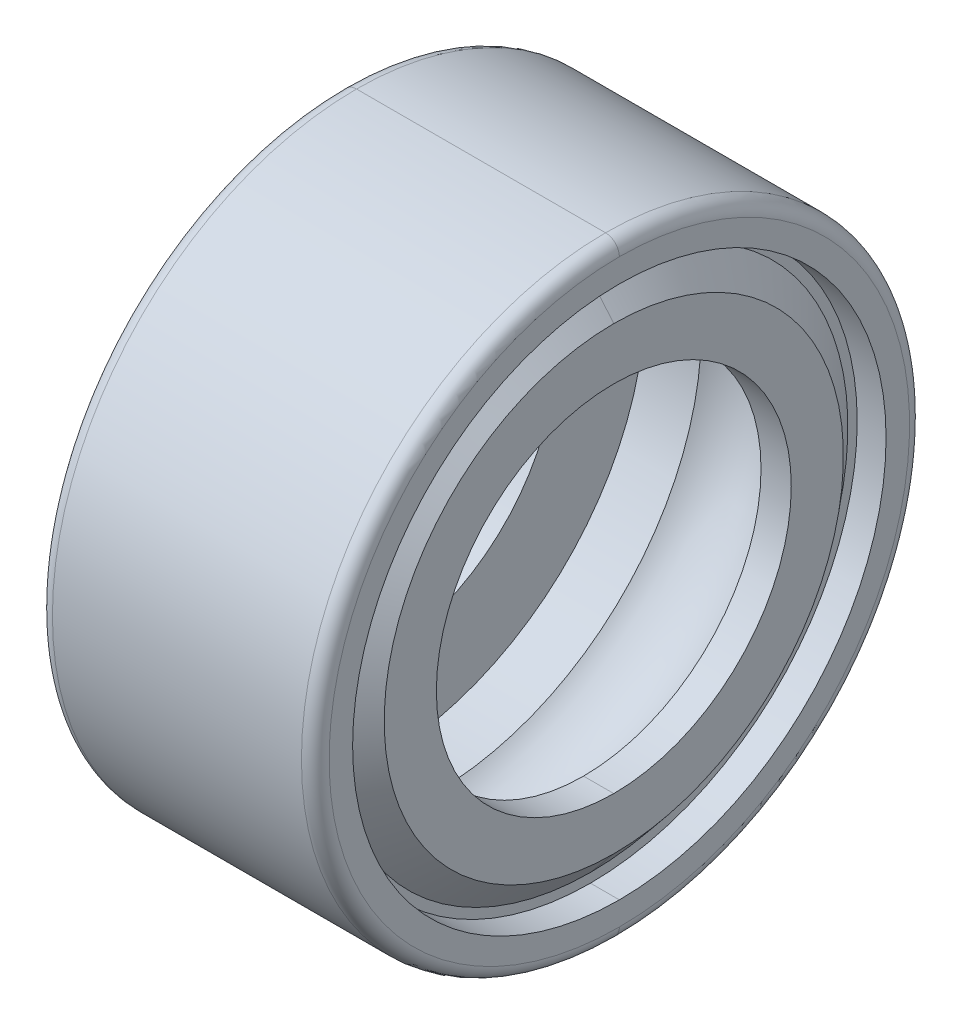
ISO-10303-21;
HEADER;
FILE_DESCRIPTION(('STEP AP214'),'2;1');
FILE_NAME('part.step','',(''),(''),'','','');
FILE_SCHEMA(('AUTOMOTIVE_DESIGN { 1 0 10303 214 1 1 1 1 }'));
ENDSEC;
DATA;
#1=APPLICATION_CONTEXT('core data for automotive mechanical design processes');
#2=APPLICATION_PROTOCOL_DEFINITION('international standard','automotive_design',2000,#1);
#3=PRODUCT_CONTEXT('',#1,'mechanical');
#4=PRODUCT('Part','Part','',(#3));
#5=PRODUCT_RELATED_PRODUCT_CATEGORY('part','',(#4));
#6=PRODUCT_DEFINITION_FORMATION('','',#4);
#7=PRODUCT_DEFINITION_CONTEXT('part definition',#1,'design');
#8=PRODUCT_DEFINITION('design','',#6,#7);
#9=PRODUCT_DEFINITION_SHAPE('','',#8);
#10=(LENGTH_UNIT() NAMED_UNIT(*) SI_UNIT(.MILLI.,.METRE.));
#11=(NAMED_UNIT(*) PLANE_ANGLE_UNIT() SI_UNIT($,.RADIAN.));
#12=(NAMED_UNIT(*) SI_UNIT($,.STERADIAN.) SOLID_ANGLE_UNIT());
#13=UNCERTAINTY_MEASURE_WITH_UNIT(LENGTH_MEASURE(1.E-05),#10,'distance_accuracy_value','');
#14=(GEOMETRIC_REPRESENTATION_CONTEXT(3) GLOBAL_UNCERTAINTY_ASSIGNED_CONTEXT((#13)) GLOBAL_UNIT_ASSIGNED_CONTEXT((#10,
#11,#12)) REPRESENTATION_CONTEXT('',''));
#15=CARTESIAN_POINT('',(0.,0.,0.));
#16=DIRECTION('',(0.,0.,1.));
#17=DIRECTION('',(1.,0.,0.));
#18=AXIS2_PLACEMENT_3D('',#15,#16,#17);
#19=CARTESIAN_POINT('',(-1.97999333714655,0.,0.));
#20=DIRECTION('',(1.,0.,0.));
#21=DIRECTION('',(0.,1.,0.));
#22=AXIS2_PLACEMENT_3D('',#19,#20,#21);
#23=PLANE('',#22);
#24=CARTESIAN_POINT('',(-1.97999333714655,0.,0.));
#25=DIRECTION('',(-1.,0.,0.));
#26=DIRECTION('',(0.,1.,0.));
#27=AXIS2_PLACEMENT_3D('',#24,#25,#26);
#28=CIRCLE('',#27,4.6547982215);
#29=CARTESIAN_POINT('',(-1.97999333714655,4.6547982215,0.));
#30=VERTEX_POINT('',#29);
#31=CARTESIAN_POINT('',(-1.97999333714655,-4.6547982215,0.));
#32=VERTEX_POINT('',#31);
#33=EDGE_CURVE('E305',#30,#32,#28,.T.);
#34=ORIENTED_EDGE('',*,*,#33,.F.);
#35=CARTESIAN_POINT('',(-1.97999333714655,0.,0.));
#36=DIRECTION('',(1.,0.,0.));
#37=DIRECTION('',(0.,1.,0.));
#38=AXIS2_PLACEMENT_3D('',#35,#36,#37);
#39=CIRCLE('',#38,4.6547982215);
#40=EDGE_CURVE('E339',#30,#32,#39,.T.);
#41=ORIENTED_EDGE('',*,*,#40,.T.);
#42=EDGE_LOOP('',(#34,#41));
#43=FACE_BOUND('',#42,.T.);
#44=CARTESIAN_POINT('',(-1.97999333714655,0.,0.));
#45=DIRECTION('',(1.,0.,0.));
#46=DIRECTION('',(0.,-1.,0.));
#47=AXIS2_PLACEMENT_3D('',#44,#45,#46);
#48=CIRCLE('',#47,4.8236251);
#49=CARTESIAN_POINT('',(-1.97999333714655,-4.8236251,0.));
#50=VERTEX_POINT('',#49);
#51=CARTESIAN_POINT('',(-1.97999333714655,4.8236251,0.));
#52=VERTEX_POINT('',#51);
#53=EDGE_CURVE('E28',#50,#52,#48,.T.);
#54=ORIENTED_EDGE('',*,*,#53,.F.);
#55=CARTESIAN_POINT('',(-1.97999333714655,0.,0.));
#56=DIRECTION('',(1.,0.,0.));
#57=DIRECTION('',(0.,1.,0.));
#58=AXIS2_PLACEMENT_3D('',#55,#56,#57);
#59=CIRCLE('',#58,4.8236251);
#60=EDGE_CURVE('E11',#52,#50,#59,.T.);
#61=ORIENTED_EDGE('',*,*,#60,.F.);
#62=EDGE_LOOP('',(#54,#61));
#63=FACE_BOUND('',#62,.T.);
#64=ADVANCED_FACE('F17',(#43,#63),#23,.F.);
#65=CARTESIAN_POINT('',(-2.75209,0.,0.));
#66=DIRECTION('',(1.,0.,0.));
#67=DIRECTION('',(0.,-1.,0.));
#68=AXIS2_PLACEMENT_3D('',#65,#66,#67);
#69=CYLINDRICAL_SURFACE('',#68,4.8236251);
#70=DIRECTION('',(1.,0.,0.));
#71=VECTOR('',#70,1.);
#72=CARTESIAN_POINT('',(-2.5019,-4.8236251,0.));
#73=LINE('',#72,#71);
#74=CARTESIAN_POINT('',(-2.5019,-4.8236251,0.));
#75=VERTEX_POINT('',#74);
#76=EDGE_CURVE('E334',#75,#50,#73,.T.);
#77=ORIENTED_EDGE('',*,*,#76,.F.);
#78=CARTESIAN_POINT('',(-2.5019,0.,0.));
#79=DIRECTION('',(1.,0.,0.));
#80=DIRECTION('',(0.,1.,0.));
#81=AXIS2_PLACEMENT_3D('',#78,#79,#80);
#82=CIRCLE('',#81,4.8236251);
#83=CARTESIAN_POINT('',(-2.5019,4.8236251,0.));
#84=VERTEX_POINT('',#83);
#85=EDGE_CURVE('E335',#84,#75,#82,.T.);
#86=ORIENTED_EDGE('',*,*,#85,.F.);
#87=DIRECTION('',(1.,0.,0.));
#88=VECTOR('',#87,1.);
#89=CARTESIAN_POINT('',(-2.5019,4.8236251,0.));
#90=LINE('',#89,#88);
#91=EDGE_CURVE('E331',#84,#52,#90,.T.);
#92=ORIENTED_EDGE('',*,*,#91,.T.);
#93=ORIENTED_EDGE('',*,*,#60,.T.);
#94=EDGE_LOOP('',(#77,#86,#92,#93));
#95=FACE_BOUND('',#94,.T.);
#96=ADVANCED_FACE('F494',(#95),#69,.F.);
#97=CARTESIAN_POINT('',(-2.75209,0.,0.));
#98=DIRECTION('',(1.,0.,0.));
#99=DIRECTION('',(0.,-1.,0.));
#100=AXIS2_PLACEMENT_3D('',#97,#98,#99);
#101=CYLINDRICAL_SURFACE('',#100,4.8236251);
#102=ORIENTED_EDGE('',*,*,#91,.F.);
#103=CARTESIAN_POINT('',(-2.5019,0.,0.));
#104=DIRECTION('',(-1.,0.,0.));
#105=DIRECTION('',(0.,1.,0.));
#106=AXIS2_PLACEMENT_3D('',#103,#104,#105);
#107=CIRCLE('',#106,4.8236251);
#108=EDGE_CURVE('E368',#84,#75,#107,.T.);
#109=ORIENTED_EDGE('',*,*,#108,.T.);
#110=ORIENTED_EDGE('',*,*,#76,.T.);
#111=ORIENTED_EDGE('',*,*,#53,.T.);
#112=EDGE_LOOP('',(#102,#109,#110,#111));
#113=FACE_BOUND('',#112,.T.);
#114=ADVANCED_FACE('F500',(#113),#101,.F.);
#115=CARTESIAN_POINT('',(-2.5019,0.,0.));
#116=DIRECTION('',(1.,0.,0.));
#117=DIRECTION('',(0.,1.,0.));
#118=AXIS2_PLACEMENT_3D('',#115,#116,#117);
#119=PLANE('',#118);
#120=ORIENTED_EDGE('',*,*,#108,.F.);
#121=ORIENTED_EDGE('',*,*,#85,.T.);
#122=EDGE_LOOP('',(#120,#121));
#123=FACE_BOUND('',#122,.T.);
#124=CARTESIAN_POINT('',(-2.5019,0.,0.));
#125=DIRECTION('',(1.,0.,0.));
#126=DIRECTION('',(0.,1.,0.));
#127=AXIS2_PLACEMENT_3D('',#124,#125,#126);
#128=CIRCLE('',#127,5.24891);
#129=CARTESIAN_POINT('',(-2.5019,5.24891,0.));
#130=VERTEX_POINT('',#129);
#131=CARTESIAN_POINT('',(-2.5019,-5.24891,0.));
#132=VERTEX_POINT('',#131);
#133=EDGE_CURVE('E292',#130,#132,#128,.T.);
#134=ORIENTED_EDGE('',*,*,#133,.F.);
#135=CARTESIAN_POINT('',(-2.5019,0.,0.));
#136=DIRECTION('',(-1.,0.,0.));
#137=DIRECTION('',(0.,1.,0.));
#138=AXIS2_PLACEMENT_3D('',#135,#136,#137);
#139=CIRCLE('',#138,5.24891);
#140=EDGE_CURVE('E327',#130,#132,#139,.T.);
#141=ORIENTED_EDGE('',*,*,#140,.T.);
#142=EDGE_LOOP('',(#134,#141));
#143=FACE_BOUND('',#142,.T.);
#144=ADVANCED_FACE('F489',(#123,#143),#119,.F.);
#145=CARTESIAN_POINT('',(-2.25171,0.,0.));
#146=DIRECTION('',(1.,0.,0.));
#147=DIRECTION('',(0.,-1.,0.));
#148=AXIS2_PLACEMENT_3D('',#145,#146,#147);
#149=TOROIDAL_SURFACE('',#148,5.24891,0.25019);
#150=CARTESIAN_POINT('',(-2.25171,0.,0.));
#151=DIRECTION('',(-1.,0.,0.));
#152=DIRECTION('',(0.,1.,0.));
#153=AXIS2_PLACEMENT_3D('',#150,#151,#152);
#154=CIRCLE('',#153,5.4991);
#155=CARTESIAN_POINT('',(-2.25171,5.4991,0.));
#156=VERTEX_POINT('',#155);
#157=CARTESIAN_POINT('',(-2.25171,-5.4991,0.));
#158=VERTEX_POINT('',#157);
#159=EDGE_CURVE('E319',#156,#158,#154,.T.);
#160=ORIENTED_EDGE('',*,*,#159,.T.);
#161=CARTESIAN_POINT('',(-2.25171,-5.24891,0.));
#162=DIRECTION('',(0.,0.,-1.));
#163=DIRECTION('',(0.,-1.,0.));
#164=AXIS2_PLACEMENT_3D('',#161,#162,#163);
#165=CIRCLE('',#164,0.25019);
#166=EDGE_CURVE('E192',#158,#132,#165,.T.);
#167=ORIENTED_EDGE('',*,*,#166,.T.);
#168=ORIENTED_EDGE('',*,*,#140,.F.);
#169=CARTESIAN_POINT('',(-2.25171,5.24891,0.));
#170=DIRECTION('',(0.,0.,1.));
#171=DIRECTION('',(0.,1.,0.));
#172=AXIS2_PLACEMENT_3D('',#169,#170,#171);
#173=CIRCLE('',#172,0.25019);
#174=EDGE_CURVE('E291',#156,#130,#173,.T.);
#175=ORIENTED_EDGE('',*,*,#174,.F.);
#176=EDGE_LOOP('',(#160,#167,#168,#175));
#177=FACE_BOUND('',#176,.T.);
#178=ADVANCED_FACE('F478',(#177),#149,.T.);
#179=CARTESIAN_POINT('',(-2.25171,0.,0.));
#180=DIRECTION('',(1.,0.,0.));
#181=DIRECTION('',(0.,-1.,0.));
#182=AXIS2_PLACEMENT_3D('',#179,#180,#181);
#183=TOROIDAL_SURFACE('',#182,5.24891,0.25019);
#184=ORIENTED_EDGE('',*,*,#133,.T.);
#185=ORIENTED_EDGE('',*,*,#166,.F.);
#186=CARTESIAN_POINT('',(-2.25171,0.,0.));
#187=DIRECTION('',(1.,0.,0.));
#188=DIRECTION('',(0.,1.,0.));
#189=AXIS2_PLACEMENT_3D('',#186,#187,#188);
#190=CIRCLE('',#189,5.4991);
#191=EDGE_CURVE('E350',#156,#158,#190,.T.);
#192=ORIENTED_EDGE('',*,*,#191,.F.);
#193=ORIENTED_EDGE('',*,*,#174,.T.);
#194=EDGE_LOOP('',(#184,#185,#192,#193));
#195=FACE_BOUND('',#194,.T.);
#196=ADVANCED_FACE('F480',(#195),#183,.T.);
#197=CARTESIAN_POINT('',(-2.75209,0.,0.));
#198=DIRECTION('',(1.,0.,0.));
#199=DIRECTION('',(0.,-1.,0.));
#200=AXIS2_PLACEMENT_3D('',#197,#198,#199);
#201=CYLINDRICAL_SURFACE('',#200,5.4991);
#202=ORIENTED_EDGE('',*,*,#191,.T.);
#203=DIRECTION('',(-1.,0.,0.));
#204=VECTOR('',#203,1.);
#205=CARTESIAN_POINT('',(2.25171,-5.4991,0.));
#206=LINE('',#205,#204);
#207=CARTESIAN_POINT('',(2.25171,-5.4991,0.));
#208=VERTEX_POINT('',#207);
#209=EDGE_CURVE('E203',#208,#158,#206,.T.);
#210=ORIENTED_EDGE('',*,*,#209,.F.);
#211=CARTESIAN_POINT('',(2.25171,0.,0.));
#212=DIRECTION('',(1.,0.,0.));
#213=DIRECTION('',(0.,1.,0.));
#214=AXIS2_PLACEMENT_3D('',#211,#212,#213);
#215=CIRCLE('',#214,5.4991);
#216=CARTESIAN_POINT('',(2.25171,5.4991,0.));
#217=VERTEX_POINT('',#216);
#218=EDGE_CURVE('E349',#217,#208,#215,.T.);
#219=ORIENTED_EDGE('',*,*,#218,.F.);
#220=DIRECTION('',(-1.,0.,0.));
#221=VECTOR('',#220,1.);
#222=CARTESIAN_POINT('',(2.25171,5.4991,0.));
#223=LINE('',#222,#221);
#224=EDGE_CURVE('E322',#217,#156,#223,.T.);
#225=ORIENTED_EDGE('',*,*,#224,.T.);
#226=EDGE_LOOP('',(#202,#210,#219,#225));
#227=FACE_BOUND('',#226,.T.);
#228=ADVANCED_FACE('F475',(#227),#201,.T.);
#229=CARTESIAN_POINT('',(-2.75209,0.,0.));
#230=DIRECTION('',(1.,0.,0.));
#231=DIRECTION('',(0.,-1.,0.));
#232=AXIS2_PLACEMENT_3D('',#229,#230,#231);
#233=CYLINDRICAL_SURFACE('',#232,5.4991);
#234=CARTESIAN_POINT('',(2.25171,0.,0.));
#235=DIRECTION('',(-1.,0.,0.));
#236=DIRECTION('',(0.,1.,0.));
#237=AXIS2_PLACEMENT_3D('',#234,#235,#236);
#238=CIRCLE('',#237,5.4991);
#239=EDGE_CURVE('E381',#217,#208,#238,.T.);
#240=ORIENTED_EDGE('',*,*,#239,.T.);
#241=ORIENTED_EDGE('',*,*,#209,.T.);
#242=ORIENTED_EDGE('',*,*,#159,.F.);
#243=ORIENTED_EDGE('',*,*,#224,.F.);
#244=EDGE_LOOP('',(#240,#241,#242,#243));
#245=FACE_BOUND('',#244,.T.);
#246=ADVANCED_FACE('F466',(#245),#233,.T.);
#247=CARTESIAN_POINT('',(2.25171,0.,0.));
#248=DIRECTION('',(1.,0.,0.));
#249=DIRECTION('',(0.,-1.,0.));
#250=AXIS2_PLACEMENT_3D('',#247,#248,#249);
#251=TOROIDAL_SURFACE('',#250,5.24891,0.25019);
#252=CARTESIAN_POINT('',(2.5019,0.,0.));
#253=DIRECTION('',(-1.,0.,0.));
#254=DIRECTION('',(0.,1.,0.));
#255=AXIS2_PLACEMENT_3D('',#252,#253,#254);
#256=CIRCLE('',#255,5.24891);
#257=CARTESIAN_POINT('',(2.5019,5.24891,0.));
#258=VERTEX_POINT('',#257);
#259=CARTESIAN_POINT('',(2.5019,-5.24891,0.));
#260=VERTEX_POINT('',#259);
#261=EDGE_CURVE('E360',#258,#260,#256,.T.);
#262=ORIENTED_EDGE('',*,*,#261,.T.);
#263=CARTESIAN_POINT('',(2.25171,-5.24891,0.));
#264=DIRECTION('',(0.,0.,-1.));
#265=DIRECTION('',(1.,0.,0.));
#266=AXIS2_PLACEMENT_3D('',#263,#264,#265);
#267=CIRCLE('',#266,0.25019);
#268=EDGE_CURVE('E344',#260,#208,#267,.T.);
#269=ORIENTED_EDGE('',*,*,#268,.T.);
#270=ORIENTED_EDGE('',*,*,#239,.F.);
#271=CARTESIAN_POINT('',(2.25171,5.24891,0.));
#272=DIRECTION('',(0.,0.,1.));
#273=DIRECTION('',(1.,0.,0.));
#274=AXIS2_PLACEMENT_3D('',#271,#272,#273);
#275=CIRCLE('',#274,0.25019);
#276=EDGE_CURVE('E348',#258,#217,#275,.T.);
#277=ORIENTED_EDGE('',*,*,#276,.F.);
#278=EDGE_LOOP('',(#262,#269,#270,#277));
#279=FACE_BOUND('',#278,.T.);
#280=ADVANCED_FACE('F470',(#279),#251,.T.);
#281=CARTESIAN_POINT('',(2.25171,0.,0.));
#282=DIRECTION('',(1.,0.,0.));
#283=DIRECTION('',(0.,-1.,0.));
#284=AXIS2_PLACEMENT_3D('',#281,#282,#283);
#285=TOROIDAL_SURFACE('',#284,5.24891,0.25019);
#286=ORIENTED_EDGE('',*,*,#218,.T.);
#287=ORIENTED_EDGE('',*,*,#268,.F.);
#288=CARTESIAN_POINT('',(2.5019,0.,0.));
#289=DIRECTION('',(1.,0.,0.));
#290=DIRECTION('',(0.,1.,0.));
#291=AXIS2_PLACEMENT_3D('',#288,#289,#290);
#292=CIRCLE('',#291,5.24891);
#293=EDGE_CURVE('E388',#258,#260,#292,.T.);
#294=ORIENTED_EDGE('',*,*,#293,.F.);
#295=ORIENTED_EDGE('',*,*,#276,.T.);
#296=EDGE_LOOP('',(#286,#287,#294,#295));
#297=FACE_BOUND('',#296,.T.);
#298=ADVANCED_FACE('F474',(#297),#285,.T.);
#299=CARTESIAN_POINT('',(2.5019,0.,0.));
#300=DIRECTION('',(1.,0.,0.));
#301=DIRECTION('',(0.,1.,0.));
#302=AXIS2_PLACEMENT_3D('',#299,#300,#301);
#303=PLANE('',#302);
#304=CARTESIAN_POINT('',(2.5019,0.,0.));
#305=DIRECTION('',(1.,0.,0.));
#306=DIRECTION('',(0.,1.,0.));
#307=AXIS2_PLACEMENT_3D('',#304,#305,#306);
#308=CIRCLE('',#307,4.8236251);
#309=CARTESIAN_POINT('',(2.5019,4.8236251,0.));
#310=VERTEX_POINT('',#309);
#311=CARTESIAN_POINT('',(2.5019,-4.8236251,0.));
#312=VERTEX_POINT('',#311);
#313=EDGE_CURVE('E278',#310,#312,#308,.T.);
#314=ORIENTED_EDGE('',*,*,#313,.F.);
#315=CARTESIAN_POINT('',(2.5019,0.,0.));
#316=DIRECTION('',(-1.,0.,0.));
#317=DIRECTION('',(0.,1.,0.));
#318=AXIS2_PLACEMENT_3D('',#315,#316,#317);
#319=CIRCLE('',#318,4.8236251);
#320=EDGE_CURVE('E356',#310,#312,#319,.T.);
#321=ORIENTED_EDGE('',*,*,#320,.T.);
#322=EDGE_LOOP('',(#314,#321));
#323=FACE_BOUND('',#322,.T.);
#324=ORIENTED_EDGE('',*,*,#261,.F.);
#325=ORIENTED_EDGE('',*,*,#293,.T.);
#326=EDGE_LOOP('',(#324,#325));
#327=FACE_BOUND('',#326,.T.);
#328=ADVANCED_FACE('F526',(#323,#327),#303,.T.);
#329=CARTESIAN_POINT('',(-2.75209,0.,0.));
#330=DIRECTION('',(1.,0.,0.));
#331=DIRECTION('',(0.,-1.,0.));
#332=AXIS2_PLACEMENT_3D('',#329,#330,#331);
#333=CYLINDRICAL_SURFACE('',#332,4.8236251);
#334=DIRECTION('',(1.,0.,0.));
#335=VECTOR('',#334,1.);
#336=CARTESIAN_POINT('',(1.97999333714655,-4.8236251,0.));
#337=LINE('',#336,#335);
#338=CARTESIAN_POINT('',(1.97999333714655,-4.8236251,0.));
#339=VERTEX_POINT('',#338);
#340=EDGE_CURVE('E282',#339,#312,#337,.T.);
#341=ORIENTED_EDGE('',*,*,#340,.T.);
#342=ORIENTED_EDGE('',*,*,#320,.F.);
#343=DIRECTION('',(1.,0.,0.));
#344=VECTOR('',#343,1.);
#345=CARTESIAN_POINT('',(1.97999333714655,4.8236251,0.));
#346=LINE('',#345,#344);
#347=CARTESIAN_POINT('',(1.97999333714655,4.8236251,0.));
#348=VERTEX_POINT('',#347);
#349=EDGE_CURVE('E283',#348,#310,#346,.T.);
#350=ORIENTED_EDGE('',*,*,#349,.F.);
#351=CARTESIAN_POINT('',(1.97999333714655,0.,0.));
#352=DIRECTION('',(1.,0.,0.));
#353=DIRECTION('',(0.,-1.,0.));
#354=AXIS2_PLACEMENT_3D('',#351,#352,#353);
#355=CIRCLE('',#354,4.8236251);
#356=EDGE_CURVE('E361',#339,#348,#355,.T.);
#357=ORIENTED_EDGE('',*,*,#356,.F.);
#358=EDGE_LOOP('',(#341,#342,#350,#357));
#359=FACE_BOUND('',#358,.T.);
#360=ADVANCED_FACE('F505',(#359),#333,.F.);
#361=CARTESIAN_POINT('',(1.97999333714655,0.,0.));
#362=DIRECTION('',(1.,0.,0.));
#363=DIRECTION('',(0.,1.,0.));
#364=AXIS2_PLACEMENT_3D('',#361,#362,#363);
#365=PLANE('',#364);
#366=CARTESIAN_POINT('',(1.97999333714655,0.,0.));
#367=DIRECTION('',(1.,0.,0.));
#368=DIRECTION('',(0.,1.,0.));
#369=AXIS2_PLACEMENT_3D('',#366,#367,#368);
#370=CIRCLE('',#369,4.6547982215);
#371=CARTESIAN_POINT('',(1.97999333714655,4.6547982215,0.));
#372=VERTEX_POINT('',#371);
#373=CARTESIAN_POINT('',(1.97999333714655,-4.6547982215,0.));
#374=VERTEX_POINT('',#373);
#375=EDGE_CURVE('E268',#372,#374,#370,.T.);
#376=ORIENTED_EDGE('',*,*,#375,.F.);
#377=CARTESIAN_POINT('',(1.97999333714655,0.,0.));
#378=DIRECTION('',(-1.,0.,0.));
#379=DIRECTION('',(0.,1.,0.));
#380=AXIS2_PLACEMENT_3D('',#377,#378,#379);
#381=CIRCLE('',#380,4.6547982215);
#382=EDGE_CURVE('E316',#372,#374,#381,.T.);
#383=ORIENTED_EDGE('',*,*,#382,.T.);
#384=EDGE_LOOP('',(#376,#383));
#385=FACE_BOUND('',#384,.T.);
#386=ORIENTED_EDGE('',*,*,#356,.T.);
#387=CARTESIAN_POINT('',(1.97999333714655,0.,0.));
#388=DIRECTION('',(1.,0.,0.));
#389=DIRECTION('',(0.,1.,0.));
#390=AXIS2_PLACEMENT_3D('',#387,#388,#389);
#391=CIRCLE('',#390,4.8236251);
#392=EDGE_CURVE('E414',#348,#339,#391,.T.);
#393=ORIENTED_EDGE('',*,*,#392,.T.);
#394=EDGE_LOOP('',(#386,#393));
#395=FACE_BOUND('',#394,.T.);
#396=ADVANCED_FACE('F535',(#385,#395),#365,.T.);
#397=CARTESIAN_POINT('',(-2.75209,0.,0.));
#398=DIRECTION('',(1.,0.,0.));
#399=DIRECTION('',(0.,-1.,0.));
#400=AXIS2_PLACEMENT_3D('',#397,#398,#399);
#401=CYLINDRICAL_SURFACE('',#400,4.8236251);
#402=ORIENTED_EDGE('',*,*,#349,.T.);
#403=ORIENTED_EDGE('',*,*,#313,.T.);
#404=ORIENTED_EDGE('',*,*,#340,.F.);
#405=ORIENTED_EDGE('',*,*,#392,.F.);
#406=EDGE_LOOP('',(#402,#403,#404,#405));
#407=FACE_BOUND('',#406,.T.);
#408=ADVANCED_FACE('F511',(#407),#401,.F.);
#409=CARTESIAN_POINT('',(2.41442691132523,0.,0.));
#410=DIRECTION('',(-1.,0.,0.));
#411=DIRECTION('',(0.,1.,0.));
#412=AXIS2_PLACEMENT_3D('',#409,#410,#411);
#413=CONICAL_SURFACE('',#412,4.13706044872901,0.872664625997165);
#414=CARTESIAN_POINT('',(2.401824,0.,0.));
#415=DIRECTION('',(-1.,0.,0.));
#416=DIRECTION('',(0.,1.,0.));
#417=AXIS2_PLACEMENT_3D('',#414,#415,#416);
#418=CIRCLE('',#417,4.152080013578);
#419=CARTESIAN_POINT('',(2.401824,4.152080013578,0.));
#420=VERTEX_POINT('',#419);
#421=CARTESIAN_POINT('',(2.401824,-4.152080013578,0.));
#422=VERTEX_POINT('',#421);
#423=EDGE_CURVE('E230',#420,#422,#418,.T.);
#424=ORIENTED_EDGE('',*,*,#423,.T.);
#425=DIRECTION('',(-0.642787609686539,-0.766044443118978,0.));
#426=VECTOR('',#425,1.);
#427=CARTESIAN_POINT('',(2.401824,-4.152080013578,0.));
#428=LINE('',#427,#426);
#429=EDGE_CURVE('E273',#422,#374,#428,.T.);
#430=ORIENTED_EDGE('',*,*,#429,.T.);
#431=ORIENTED_EDGE('',*,*,#382,.F.);
#432=DIRECTION('',(-0.642787609686539,0.766044443118978,0.));
#433=VECTOR('',#432,1.);
#434=CARTESIAN_POINT('',(2.401824,4.152080013578,0.));
#435=LINE('',#434,#433);
#436=EDGE_CURVE('E277',#420,#372,#435,.T.);
#437=ORIENTED_EDGE('',*,*,#436,.F.);
#438=EDGE_LOOP('',(#424,#430,#431,#437));
#439=FACE_BOUND('',#438,.T.);
#440=ADVANCED_FACE('F507',(#439),#413,.T.);
#441=CARTESIAN_POINT('',(2.41442691132523,0.,0.));
#442=DIRECTION('',(-1.,0.,0.));
#443=DIRECTION('',(0.,1.,0.));
#444=AXIS2_PLACEMENT_3D('',#441,#442,#443);
#445=CONICAL_SURFACE('',#444,4.13706044872901,0.872664625997165);
#446=ORIENTED_EDGE('',*,*,#375,.T.);
#447=ORIENTED_EDGE('',*,*,#429,.F.);
#448=CARTESIAN_POINT('',(2.401824,0.,0.));
#449=DIRECTION('',(1.,0.,0.));
#450=DIRECTION('',(0.,1.,0.));
#451=AXIS2_PLACEMENT_3D('',#448,#449,#450);
#452=CIRCLE('',#451,4.152080013578);
#453=EDGE_CURVE('E259',#420,#422,#452,.T.);
#454=ORIENTED_EDGE('',*,*,#453,.F.);
#455=ORIENTED_EDGE('',*,*,#436,.T.);
#456=EDGE_LOOP('',(#446,#447,#454,#455));
#457=FACE_BOUND('',#456,.T.);
#458=ADVANCED_FACE('F510',(#457),#445,.T.);
#459=CARTESIAN_POINT('',(2.401824,0.,0.));
#460=DIRECTION('',(1.,0.,0.));
#461=DIRECTION('',(0.,1.,0.));
#462=AXIS2_PLACEMENT_3D('',#459,#460,#461);
#463=PLANE('',#462);
#464=CARTESIAN_POINT('',(2.401824,0.,0.));
#465=DIRECTION('',(1.,0.,0.));
#466=DIRECTION('',(0.,1.,0.));
#467=AXIS2_PLACEMENT_3D('',#464,#465,#466);
#468=CIRCLE('',#467,3.209148649);
#469=CARTESIAN_POINT('',(2.401824,3.209148649,0.));
#470=VERTEX_POINT('',#469);
#471=CARTESIAN_POINT('',(2.401824,-3.209148649,0.));
#472=VERTEX_POINT('',#471);
#473=EDGE_CURVE('E234',#470,#472,#468,.T.);
#474=ORIENTED_EDGE('',*,*,#473,.F.);
#475=CARTESIAN_POINT('',(2.401824,0.,0.));
#476=DIRECTION('',(-1.,0.,0.));
#477=DIRECTION('',(0.,1.,0.));
#478=AXIS2_PLACEMENT_3D('',#475,#476,#477);
#479=CIRCLE('',#478,3.209148649);
#480=EDGE_CURVE('E219',#470,#472,#479,.T.);
#481=ORIENTED_EDGE('',*,*,#480,.T.);
#482=EDGE_LOOP('',(#474,#481));
#483=FACE_BOUND('',#482,.T.);
#484=ORIENTED_EDGE('',*,*,#423,.F.);
#485=ORIENTED_EDGE('',*,*,#453,.T.);
#486=EDGE_LOOP('',(#484,#485));
#487=FACE_BOUND('',#486,.T.);
#488=ADVANCED_FACE('F240',(#483,#487),#463,.T.);
#489=CARTESIAN_POINT('',(-2.6420064,0.,0.));
#490=DIRECTION('',(1.,0.,0.));
#491=DIRECTION('',(0.,-1.,0.));
#492=AXIS2_PLACEMENT_3D('',#489,#490,#491);
#493=CYLINDRICAL_SURFACE('',#492,3.209148649);
#494=CARTESIAN_POINT('',(1.85489833714655,0.,0.));
#495=DIRECTION('',(-1.,0.,0.));
#496=DIRECTION('',(0.,1.,0.));
#497=AXIS2_PLACEMENT_3D('',#494,#495,#496);
#498=CIRCLE('',#497,3.209148649);
#499=CARTESIAN_POINT('',(1.85489833714655,3.209148649,0.));
#500=VERTEX_POINT('',#499);
#501=CARTESIAN_POINT('',(1.85489833714655,-3.209148649,0.));
#502=VERTEX_POINT('',#501);
#503=EDGE_CURVE('E250',#500,#502,#498,.T.);
#504=ORIENTED_EDGE('',*,*,#503,.T.);
#505=DIRECTION('',(1.,0.,0.));
#506=VECTOR('',#505,1.);
#507=CARTESIAN_POINT('',(1.85489833714655,-3.209148649,0.));
#508=LINE('',#507,#506);
#509=EDGE_CURVE('E225',#502,#472,#508,.T.);
#510=ORIENTED_EDGE('',*,*,#509,.T.);
#511=ORIENTED_EDGE('',*,*,#480,.F.);
#512=DIRECTION('',(1.,0.,0.));
#513=VECTOR('',#512,1.);
#514=CARTESIAN_POINT('',(1.85489833714655,3.209148649,0.));
#515=LINE('',#514,#513);
#516=EDGE_CURVE('E223',#500,#470,#515,.T.);
#517=ORIENTED_EDGE('',*,*,#516,.F.);
#518=EDGE_LOOP('',(#504,#510,#511,#517));
#519=FACE_BOUND('',#518,.T.);
#520=ADVANCED_FACE('F222',(#519),#493,.F.);
#521=CARTESIAN_POINT('',(-2.6420064,0.,0.));
#522=DIRECTION('',(1.,0.,0.));
#523=DIRECTION('',(0.,-1.,0.));
#524=AXIS2_PLACEMENT_3D('',#521,#522,#523);
#525=CYLINDRICAL_SURFACE('',#524,3.209148649);
#526=ORIENTED_EDGE('',*,*,#473,.T.);
#527=ORIENTED_EDGE('',*,*,#509,.F.);
#528=CARTESIAN_POINT('',(1.85489833714655,0.,0.));
#529=DIRECTION('',(1.,0.,0.));
#530=DIRECTION('',(0.,1.,0.));
#531=AXIS2_PLACEMENT_3D('',#528,#529,#530);
#532=CIRCLE('',#531,3.209148649);
#533=EDGE_CURVE('E236',#500,#502,#532,.T.);
#534=ORIENTED_EDGE('',*,*,#533,.F.);
#535=ORIENTED_EDGE('',*,*,#516,.T.);
#536=EDGE_LOOP('',(#526,#527,#534,#535));
#537=FACE_BOUND('',#536,.T.);
#538=ADVANCED_FACE('F233',(#537),#525,.F.);
#539=CARTESIAN_POINT('',(1.85489833714655,0.,0.));
#540=DIRECTION('',(1.,0.,0.));
#541=DIRECTION('',(0.,1.,0.));
#542=AXIS2_PLACEMENT_3D('',#539,#540,#541);
#543=PLANE('',#542);
#544=ORIENTED_EDGE('',*,*,#503,.F.);
#545=ORIENTED_EDGE('',*,*,#533,.T.);
#546=EDGE_LOOP('',(#544,#545));
#547=FACE_BOUND('',#546,.T.);
#548=CARTESIAN_POINT('',(1.85489833714655,0.,0.));
#549=DIRECTION('',(1.,0.,0.));
#550=DIRECTION('',(0.,-1.,0.));
#551=AXIS2_PLACEMENT_3D('',#548,#549,#550);
#552=CIRCLE('',#551,4.8236251);
#553=CARTESIAN_POINT('',(1.85489833714655,-4.8236251,0.));
#554=VERTEX_POINT('',#553);
#555=CARTESIAN_POINT('',(1.85489833714655,4.8236251,0.));
#556=VERTEX_POINT('',#555);
#557=EDGE_CURVE('E21',#554,#556,#552,.T.);
#558=ORIENTED_EDGE('',*,*,#557,.F.);
#559=CARTESIAN_POINT('',(1.85489833714655,0.,0.));
#560=DIRECTION('',(1.,0.,0.));
#561=DIRECTION('',(0.,1.,0.));
#562=AXIS2_PLACEMENT_3D('',#559,#560,#561);
#563=CIRCLE('',#562,4.8236251);
#564=EDGE_CURVE('E269',#556,#554,#563,.T.);
#565=ORIENTED_EDGE('',*,*,#564,.F.);
#566=EDGE_LOOP('',(#558,#565));
#567=FACE_BOUND('',#566,.T.);
#568=ADVANCED_FACE('F513',(#547,#567),#543,.F.);
#569=CARTESIAN_POINT('',(-2.75209,0.,0.));
#570=DIRECTION('',(1.,0.,0.));
#571=DIRECTION('',(0.,-1.,0.));
#572=AXIS2_PLACEMENT_3D('',#569,#570,#571);
#573=CYLINDRICAL_SURFACE('',#572,4.8236251);
#574=DIRECTION('',(1.,0.,0.));
#575=VECTOR('',#574,1.);
#576=CARTESIAN_POINT('',(0.839755569912453,-4.8236251,0.));
#577=LINE('',#576,#575);
#578=CARTESIAN_POINT('',(0.839755569912453,-4.8236251,0.));
#579=VERTEX_POINT('',#578);
#580=EDGE_CURVE('E362',#579,#554,#577,.T.);
#581=ORIENTED_EDGE('',*,*,#580,.F.);
#582=CARTESIAN_POINT('',(0.839755569912455,0.,0.));
#583=DIRECTION('',(1.,0.,0.));
#584=DIRECTION('',(0.,1.,0.));
#585=AXIS2_PLACEMENT_3D('',#582,#583,#584);
#586=CIRCLE('',#585,4.8236251);
#587=CARTESIAN_POINT('',(0.839755569912453,4.8236251,0.));
#588=VERTEX_POINT('',#587);
#589=EDGE_CURVE('E384',#588,#579,#586,.T.);
#590=ORIENTED_EDGE('',*,*,#589,.F.);
#591=DIRECTION('',(1.,0.,0.));
#592=VECTOR('',#591,1.);
#593=CARTESIAN_POINT('',(0.839755569912453,4.8236251,0.));
#594=LINE('',#593,#592);
#595=EDGE_CURVE('E315',#588,#556,#594,.T.);
#596=ORIENTED_EDGE('',*,*,#595,.T.);
#597=ORIENTED_EDGE('',*,*,#564,.T.);
#598=EDGE_LOOP('',(#581,#590,#596,#597));
#599=FACE_BOUND('',#598,.T.);
#600=ADVANCED_FACE('F516',(#599),#573,.F.);
#601=CARTESIAN_POINT('',(-2.75209,0.,0.));
#602=DIRECTION('',(1.,0.,0.));
#603=DIRECTION('',(0.,-1.,0.));
#604=AXIS2_PLACEMENT_3D('',#601,#602,#603);
#605=CYLINDRICAL_SURFACE('',#604,4.8236251);
#606=ORIENTED_EDGE('',*,*,#595,.F.);
#607=CARTESIAN_POINT('',(0.839755569912455,0.,0.));
#608=DIRECTION('',(-1.,0.,0.));
#609=DIRECTION('',(0.,1.,0.));
#610=AXIS2_PLACEMENT_3D('',#607,#608,#609);
#611=CIRCLE('',#610,4.8236251);
#612=EDGE_CURVE('E304',#588,#579,#611,.T.);
#613=ORIENTED_EDGE('',*,*,#612,.T.);
#614=ORIENTED_EDGE('',*,*,#580,.T.);
#615=ORIENTED_EDGE('',*,*,#557,.T.);
#616=EDGE_LOOP('',(#606,#613,#614,#615));
#617=FACE_BOUND('',#616,.T.);
#618=ADVANCED_FACE('F542',(#617),#605,.F.);
#619=CARTESIAN_POINT('',(0.,0.,0.));
#620=DIRECTION('',(1.,0.,0.));
#621=DIRECTION('',(0.,-1.,0.));
#622=AXIS2_PLACEMENT_3D('',#619,#620,#621);
#623=TOROIDAL_SURFACE('',#622,4.0005,1.175893);
#624=CARTESIAN_POINT('',(-0.839755569912454,0.,0.));
#625=DIRECTION('',(-1.,0.,0.));
#626=DIRECTION('',(0.,1.,0.));
#627=AXIS2_PLACEMENT_3D('',#624,#625,#626);
#628=CIRCLE('',#627,4.8236251);
#629=CARTESIAN_POINT('',(-0.839755569912454,4.8236251,0.));
#630=VERTEX_POINT('',#629);
#631=CARTESIAN_POINT('',(-0.839755569912454,-4.8236251,0.));
#632=VERTEX_POINT('',#631);
#633=EDGE_CURVE('E298',#630,#632,#628,.T.);
#634=ORIENTED_EDGE('',*,*,#633,.T.);
#635=CARTESIAN_POINT('',(0.,-4.0005,0.));
#636=DIRECTION('',(0.,0.,1.));
#637=DIRECTION('',(-0.714142842854285,-0.7,0.));
#638=AXIS2_PLACEMENT_3D('',#635,#636,#637);
#639=CIRCLE('',#638,1.175893);
#640=EDGE_CURVE('E94',#632,#579,#639,.T.);
#641=ORIENTED_EDGE('',*,*,#640,.T.);
#642=ORIENTED_EDGE('',*,*,#612,.F.);
#643=CARTESIAN_POINT('',(0.,4.0005,0.));
#644=DIRECTION('',(0.,0.,-1.));
#645=DIRECTION('',(-0.714142842854285,0.7,0.));
#646=AXIS2_PLACEMENT_3D('',#643,#644,#645);
#647=CIRCLE('',#646,1.175893);
#648=EDGE_CURVE('E78',#630,#588,#647,.T.);
#649=ORIENTED_EDGE('',*,*,#648,.F.);
#650=EDGE_LOOP('',(#634,#641,#642,#649));
#651=FACE_BOUND('',#650,.T.);
#652=ADVANCED_FACE('F547',(#651),#623,.F.);
#653=CARTESIAN_POINT('',(0.,0.,0.));
#654=DIRECTION('',(1.,0.,0.));
#655=DIRECTION('',(0.,-1.,0.));
#656=AXIS2_PLACEMENT_3D('',#653,#654,#655);
#657=TOROIDAL_SURFACE('',#656,4.0005,1.175893);
#658=ORIENTED_EDGE('',*,*,#589,.T.);
#659=ORIENTED_EDGE('',*,*,#640,.F.);
#660=CARTESIAN_POINT('',(-0.839755569912454,0.,0.));
#661=DIRECTION('',(1.,0.,0.));
#662=DIRECTION('',(0.,1.,0.));
#663=AXIS2_PLACEMENT_3D('',#660,#661,#662);
#664=CIRCLE('',#663,4.8236251);
#665=EDGE_CURVE('E397',#630,#632,#664,.T.);
#666=ORIENTED_EDGE('',*,*,#665,.F.);
#667=ORIENTED_EDGE('',*,*,#648,.T.);
#668=EDGE_LOOP('',(#658,#659,#666,#667));
#669=FACE_BOUND('',#668,.T.);
#670=ADVANCED_FACE('F19',(#669),#657,.F.);
#671=CARTESIAN_POINT('',(-2.75209,0.,0.));
#672=DIRECTION('',(1.,0.,0.));
#673=DIRECTION('',(0.,-1.,0.));
#674=AXIS2_PLACEMENT_3D('',#671,#672,#673);
#675=CYLINDRICAL_SURFACE('',#674,4.8236251);
#676=DIRECTION('',(1.,0.,0.));
#677=VECTOR('',#676,1.);
#678=CARTESIAN_POINT('',(-1.85489833714655,4.8236251,0.));
#679=LINE('',#678,#677);
#680=CARTESIAN_POINT('',(-1.85489833714655,4.8236251,0.));
#681=VERTEX_POINT('',#680);
#682=EDGE_CURVE('E301',#681,#630,#679,.T.);
#683=ORIENTED_EDGE('',*,*,#682,.T.);
#684=ORIENTED_EDGE('',*,*,#665,.T.);
#685=DIRECTION('',(1.,0.,0.));
#686=VECTOR('',#685,1.);
#687=CARTESIAN_POINT('',(-1.85489833714655,-4.8236251,0.));
#688=LINE('',#687,#686);
#689=CARTESIAN_POINT('',(-1.85489833714655,-4.8236251,0.));
#690=VERTEX_POINT('',#689);
#691=EDGE_CURVE('E263',#690,#632,#688,.T.);
#692=ORIENTED_EDGE('',*,*,#691,.F.);
#693=CARTESIAN_POINT('',(-1.85489833714655,0.,0.));
#694=DIRECTION('',(1.,0.,0.));
#695=DIRECTION('',(0.,1.,0.));
#696=AXIS2_PLACEMENT_3D('',#693,#694,#695);
#697=CIRCLE('',#696,4.8236251);
#698=EDGE_CURVE('E375',#681,#690,#697,.T.);
#699=ORIENTED_EDGE('',*,*,#698,.F.);
#700=EDGE_LOOP('',(#683,#684,#692,#699));
#701=FACE_BOUND('',#700,.T.);
#702=ADVANCED_FACE('F557',(#701),#675,.F.);
#703=CARTESIAN_POINT('',(-1.85489833714655,0.,0.));
#704=DIRECTION('',(1.,0.,0.));
#705=DIRECTION('',(0.,1.,0.));
#706=AXIS2_PLACEMENT_3D('',#703,#704,#705);
#707=PLANE('',#706);
#708=CARTESIAN_POINT('',(-1.85489833714655,0.,0.));
#709=DIRECTION('',(1.,0.,0.));
#710=DIRECTION('',(0.,1.,0.));
#711=AXIS2_PLACEMENT_3D('',#708,#709,#710);
#712=CIRCLE('',#711,3.209148649);
#713=CARTESIAN_POINT('',(-1.85489833714655,3.209148649,0.));
#714=VERTEX_POINT('',#713);
#715=CARTESIAN_POINT('',(-1.85489833714655,-3.209148649,0.));
#716=VERTEX_POINT('',#715);
#717=EDGE_CURVE('E288',#714,#716,#712,.T.);
#718=ORIENTED_EDGE('',*,*,#717,.F.);
#719=CARTESIAN_POINT('',(-1.85489833714655,0.,0.));
#720=DIRECTION('',(-1.,0.,0.));
#721=DIRECTION('',(0.,1.,0.));
#722=AXIS2_PLACEMENT_3D('',#719,#720,#721);
#723=CIRCLE('',#722,3.209148649);
#724=EDGE_CURVE('E260',#714,#716,#723,.T.);
#725=ORIENTED_EDGE('',*,*,#724,.T.);
#726=EDGE_LOOP('',(#718,#725));
#727=FACE_BOUND('',#726,.T.);
#728=CARTESIAN_POINT('',(-1.85489833714655,0.,0.));
#729=DIRECTION('',(1.,0.,0.));
#730=DIRECTION('',(0.,-1.,0.));
#731=AXIS2_PLACEMENT_3D('',#728,#729,#730);
#732=CIRCLE('',#731,4.8236251);
#733=EDGE_CURVE('E343',#690,#681,#732,.T.);
#734=ORIENTED_EDGE('',*,*,#733,.T.);
#735=ORIENTED_EDGE('',*,*,#698,.T.);
#736=EDGE_LOOP('',(#734,#735));
#737=FACE_BOUND('',#736,.T.);
#738=ADVANCED_FACE('F424',(#727,#737),#707,.T.);
#739=CARTESIAN_POINT('',(-2.75209,0.,0.));
#740=DIRECTION('',(1.,0.,0.));
#741=DIRECTION('',(0.,-1.,0.));
#742=AXIS2_PLACEMENT_3D('',#739,#740,#741);
#743=CYLINDRICAL_SURFACE('',#742,4.8236251);
#744=ORIENTED_EDGE('',*,*,#691,.T.);
#745=ORIENTED_EDGE('',*,*,#633,.F.);
#746=ORIENTED_EDGE('',*,*,#682,.F.);
#747=ORIENTED_EDGE('',*,*,#733,.F.);
#748=EDGE_LOOP('',(#744,#745,#746,#747));
#749=FACE_BOUND('',#748,.T.);
#750=ADVANCED_FACE('F556',(#749),#743,.F.);
#751=CARTESIAN_POINT('',(-2.6420064,0.,0.));
#752=DIRECTION('',(1.,0.,0.));
#753=DIRECTION('',(0.,-1.,0.));
#754=AXIS2_PLACEMENT_3D('',#751,#752,#753);
#755=CYLINDRICAL_SURFACE('',#754,3.209148649);
#756=CARTESIAN_POINT('',(-2.401824,0.,0.));
#757=DIRECTION('',(-1.,0.,0.));
#758=DIRECTION('',(0.,1.,0.));
#759=AXIS2_PLACEMENT_3D('',#756,#757,#758);
#760=CIRCLE('',#759,3.209148649);
#761=CARTESIAN_POINT('',(-2.401824,3.209148649,0.));
#762=VERTEX_POINT('',#761);
#763=CARTESIAN_POINT('',(-2.401824,-3.209148649,0.));
#764=VERTEX_POINT('',#763);
#765=EDGE_CURVE('E297',#762,#764,#760,.T.);
#766=ORIENTED_EDGE('',*,*,#765,.T.);
#767=DIRECTION('',(1.,0.,0.));
#768=VECTOR('',#767,1.);
#769=CARTESIAN_POINT('',(-2.401824,-3.209148649,0.));
#770=LINE('',#769,#768);
#771=EDGE_CURVE('E284',#764,#716,#770,.T.);
#772=ORIENTED_EDGE('',*,*,#771,.T.);
#773=ORIENTED_EDGE('',*,*,#724,.F.);
#774=DIRECTION('',(1.,0.,0.));
#775=VECTOR('',#774,1.);
#776=CARTESIAN_POINT('',(-2.401824,3.209148649,0.));
#777=LINE('',#776,#775);
#778=EDGE_CURVE('E264',#762,#714,#777,.T.);
#779=ORIENTED_EDGE('',*,*,#778,.F.);
#780=EDGE_LOOP('',(#766,#772,#773,#779));
#781=FACE_BOUND('',#780,.T.);
#782=ADVANCED_FACE('F428',(#781),#755,.F.);
#783=CARTESIAN_POINT('',(-2.6420064,0.,0.));
#784=DIRECTION('',(1.,0.,0.));
#785=DIRECTION('',(0.,-1.,0.));
#786=AXIS2_PLACEMENT_3D('',#783,#784,#785);
#787=CYLINDRICAL_SURFACE('',#786,3.209148649);
#788=ORIENTED_EDGE('',*,*,#717,.T.);
#789=ORIENTED_EDGE('',*,*,#771,.F.);
#790=CARTESIAN_POINT('',(-2.401824,0.,0.));
#791=DIRECTION('',(1.,0.,0.));
#792=DIRECTION('',(0.,1.,0.));
#793=AXIS2_PLACEMENT_3D('',#790,#791,#792);
#794=CIRCLE('',#793,3.209148649);
#795=EDGE_CURVE('E293',#762,#764,#794,.T.);
#796=ORIENTED_EDGE('',*,*,#795,.F.);
#797=ORIENTED_EDGE('',*,*,#778,.T.);
#798=EDGE_LOOP('',(#788,#789,#796,#797));
#799=FACE_BOUND('',#798,.T.);
#800=ADVANCED_FACE('F421',(#799),#787,.F.);
#801=CARTESIAN_POINT('',(-2.401824,0.,0.));
#802=DIRECTION('',(1.,0.,0.));
#803=DIRECTION('',(0.,1.,0.));
#804=AXIS2_PLACEMENT_3D('',#801,#802,#803);
#805=PLANE('',#804);
#806=ORIENTED_EDGE('',*,*,#765,.F.);
#807=ORIENTED_EDGE('',*,*,#795,.T.);
#808=EDGE_LOOP('',(#806,#807));
#809=FACE_BOUND('',#808,.T.);
#810=CARTESIAN_POINT('',(-2.401824,0.,0.));
#811=DIRECTION('',(1.,0.,0.));
#812=DIRECTION('',(0.,1.,0.));
#813=AXIS2_PLACEMENT_3D('',#810,#811,#812);
#814=CIRCLE('',#813,4.152080013578);
#815=CARTESIAN_POINT('',(-2.401824,4.152080013578,0.));
#816=VERTEX_POINT('',#815);
#817=CARTESIAN_POINT('',(-2.401824,-4.152080013578,0.));
#818=VERTEX_POINT('',#817);
#819=EDGE_CURVE('E454',#816,#818,#814,.T.);
#820=ORIENTED_EDGE('',*,*,#819,.F.);
#821=CARTESIAN_POINT('',(-2.401824,0.,0.));
#822=DIRECTION('',(-1.,0.,0.));
#823=DIRECTION('',(0.,1.,0.));
#824=AXIS2_PLACEMENT_3D('',#821,#822,#823);
#825=CIRCLE('',#824,4.152080013578);
#826=EDGE_CURVE('E254',#816,#818,#825,.T.);
#827=ORIENTED_EDGE('',*,*,#826,.T.);
#828=EDGE_LOOP('',(#820,#827));
#829=FACE_BOUND('',#828,.T.);
#830=ADVANCED_FACE('F523',(#809,#829),#805,.F.);
#831=CARTESIAN_POINT('',(-2.41442691132523,0.,0.));
#832=DIRECTION('',(1.,0.,0.));
#833=DIRECTION('',(0.,-1.,0.));
#834=AXIS2_PLACEMENT_3D('',#831,#832,#833);
#835=CONICAL_SURFACE('',#834,4.13706044872901,0.872664625997165);
#836=ORIENTED_EDGE('',*,*,#33,.T.);
#837=DIRECTION('',(-0.642787609686539,0.766044443118978,0.));
#838=VECTOR('',#837,1.);
#839=CARTESIAN_POINT('',(-1.97999333714655,-4.6547982215,0.));
#840=LINE('',#839,#838);
#841=EDGE_CURVE('E458',#32,#818,#840,.T.);
#842=ORIENTED_EDGE('',*,*,#841,.T.);
#843=ORIENTED_EDGE('',*,*,#826,.F.);
#844=DIRECTION('',(-0.642787609686539,-0.766044443118978,0.));
#845=VECTOR('',#844,1.);
#846=CARTESIAN_POINT('',(-1.97999333714655,4.6547982215,0.));
#847=LINE('',#846,#845);
#848=EDGE_CURVE('E308',#30,#816,#847,.T.);
#849=ORIENTED_EDGE('',*,*,#848,.F.);
#850=EDGE_LOOP('',(#836,#842,#843,#849));
#851=FACE_BOUND('',#850,.T.);
#852=ADVANCED_FACE('F520',(#851),#835,.T.);
#853=CARTESIAN_POINT('',(-2.41442691132523,0.,0.));
#854=DIRECTION('',(1.,0.,0.));
#855=DIRECTION('',(0.,-1.,0.));
#856=AXIS2_PLACEMENT_3D('',#853,#854,#855);
#857=CONICAL_SURFACE('',#856,4.13706044872901,0.872664625997165);
#858=ORIENTED_EDGE('',*,*,#819,.T.);
#859=ORIENTED_EDGE('',*,*,#841,.F.);
#860=ORIENTED_EDGE('',*,*,#40,.F.);
#861=ORIENTED_EDGE('',*,*,#848,.T.);
#862=EDGE_LOOP('',(#858,#859,#860,#861));
#863=FACE_BOUND('',#862,.T.);
#864=ADVANCED_FACE('F522',(#863),#857,.T.);
#865=CLOSED_SHELL('',(#64,#96,#114,#144,#178,#196,#228,#246,#280,#298,#328,#360,#396,#408,#440,
#458,#488,#520,#538,#568,#600,#618,#652,#670,#702,#738,#750,#782,#800,#830,#852,#864));
#866=MANIFOLD_SOLID_BREP('B1',#865);
#867=ADVANCED_BREP_SHAPE_REPRESENTATION('',(#18,#866),#14);
#868=SHAPE_DEFINITION_REPRESENTATION(#9,#867);
ENDSEC;
END-ISO-10303-21;
